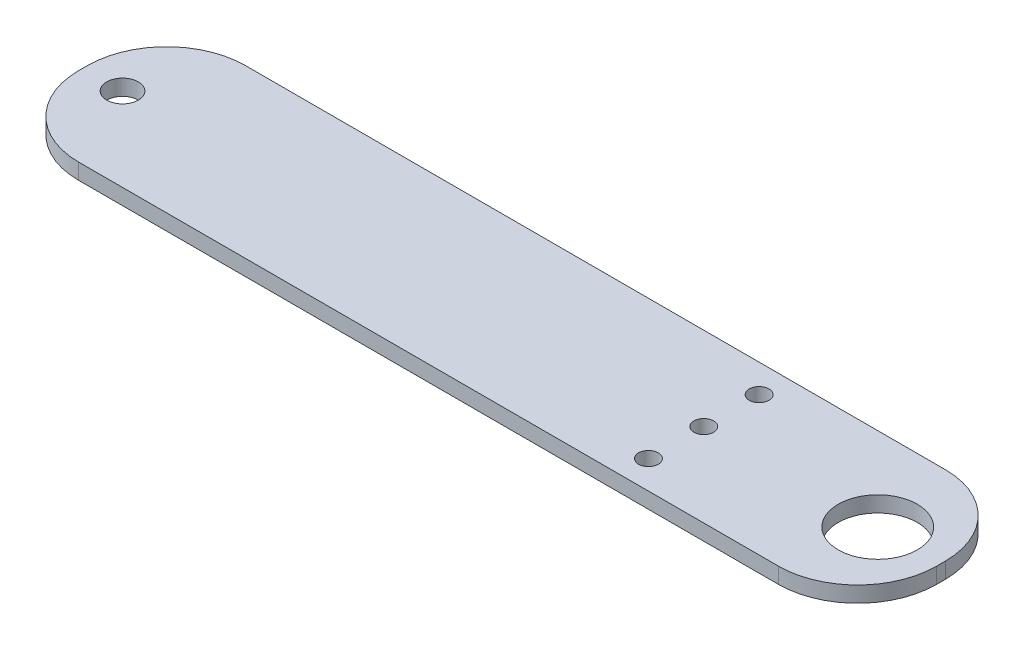
ISO-10303-21;
HEADER;
FILE_DESCRIPTION(('STEP AP214'),'2;1');
FILE_NAME('part.step','',(''),(''),'','','');
FILE_SCHEMA(('AUTOMOTIVE_DESIGN { 1 0 10303 214 1 1 1 1 }'));
ENDSEC;
DATA;
#1=APPLICATION_CONTEXT('core data for automotive mechanical design processes');
#2=APPLICATION_PROTOCOL_DEFINITION('international standard','automotive_design',2000,#1);
#3=PRODUCT_CONTEXT('',#1,'mechanical');
#4=PRODUCT('Part','Part','',(#3));
#5=PRODUCT_RELATED_PRODUCT_CATEGORY('part','',(#4));
#6=PRODUCT_DEFINITION_FORMATION('','',#4);
#7=PRODUCT_DEFINITION_CONTEXT('part definition',#1,'design');
#8=PRODUCT_DEFINITION('design','',#6,#7);
#9=PRODUCT_DEFINITION_SHAPE('','',#8);
#10=(LENGTH_UNIT() NAMED_UNIT(*) SI_UNIT(.MILLI.,.METRE.));
#11=(NAMED_UNIT(*) PLANE_ANGLE_UNIT() SI_UNIT($,.RADIAN.));
#12=(NAMED_UNIT(*) SI_UNIT($,.STERADIAN.) SOLID_ANGLE_UNIT());
#13=UNCERTAINTY_MEASURE_WITH_UNIT(LENGTH_MEASURE(1.E-05),#10,'distance_accuracy_value','');
#14=(GEOMETRIC_REPRESENTATION_CONTEXT(3) GLOBAL_UNCERTAINTY_ASSIGNED_CONTEXT((#13)) GLOBAL_UNIT_ASSIGNED_CONTEXT((#10,
#11,#12)) REPRESENTATION_CONTEXT('',''));
#15=CARTESIAN_POINT('',(0.,0.,0.));
#16=DIRECTION('',(0.,0.,1.));
#17=DIRECTION('',(1.,0.,0.));
#18=AXIS2_PLACEMENT_3D('',#15,#16,#17);
#19=CARTESIAN_POINT('',(-38.5,2.,0.));
#20=DIRECTION('',(-1.,0.,0.));
#21=DIRECTION('',(0.,0.,-1.));
#22=AXIS2_PLACEMENT_3D('',#19,#20,#21);
#23=PLANE('',#22);
#24=DIRECTION('',(0.,0.,1.));
#25=VECTOR('',#24,1.);
#26=CARTESIAN_POINT('',(-38.5,2.,0.));
#27=LINE('',#26,#25);
#28=CARTESIAN_POINT('',(-38.5,2.,-0.558375634517767));
#29=VERTEX_POINT('',#28);
#30=CARTESIAN_POINT('',(-38.5,2.,0.558375634517767));
#31=VERTEX_POINT('',#30);
#32=EDGE_CURVE('E128',#29,#31,#27,.T.);
#33=ORIENTED_EDGE('',*,*,#32,.F.);
#34=DIRECTION('',(0.,-1.,0.));
#35=VECTOR('',#34,1.);
#36=CARTESIAN_POINT('',(-38.5,2.,-0.558375634517767));
#37=LINE('',#36,#35);
#38=CARTESIAN_POINT('',(-38.5,0.,-0.558375634517767));
#39=VERTEX_POINT('',#38);
#40=EDGE_CURVE('E107',#39,#29,#37,.F.);
#41=ORIENTED_EDGE('',*,*,#40,.F.);
#42=DIRECTION('',(0.,0.,1.));
#43=VECTOR('',#42,1.);
#44=CARTESIAN_POINT('',(-38.5,0.,0.));
#45=LINE('',#44,#43);
#46=CARTESIAN_POINT('',(-38.5,0.,0.558375634517767));
#47=VERTEX_POINT('',#46);
#48=EDGE_CURVE('E118',#39,#47,#45,.T.);
#49=ORIENTED_EDGE('',*,*,#48,.T.);
#50=DIRECTION('',(0.,-1.,0.));
#51=VECTOR('',#50,1.);
#52=CARTESIAN_POINT('',(-38.5,2.,0.558375634517767));
#53=LINE('',#52,#51);
#54=EDGE_CURVE('E129',#31,#47,#53,.T.);
#55=ORIENTED_EDGE('',*,*,#54,.F.);
#56=EDGE_LOOP('',(#33,#41,#49,#55));
#57=FACE_BOUND('',#56,.T.);
#58=ADVANCED_FACE('F37',(#57),#23,.T.);
#59=CARTESIAN_POINT('',(0.,2.,-10.5583756345178));
#60=DIRECTION('',(0.,0.,1.));
#61=DIRECTION('',(-1.,0.,0.));
#62=AXIS2_PLACEMENT_3D('',#59,#60,#61);
#63=PLANE('',#62);
#64=DIRECTION('',(1.,0.,0.));
#65=VECTOR('',#64,1.);
#66=CARTESIAN_POINT('',(0.,2.,-10.5583756345178));
#67=LINE('',#66,#65);
#68=CARTESIAN_POINT('',(-28.5,2.,-10.5583756345178));
#69=VERTEX_POINT('',#68);
#70=CARTESIAN_POINT('',(60.,2.,-10.5583756345178));
#71=VERTEX_POINT('',#70);
#72=EDGE_CURVE('E164',#69,#71,#67,.T.);
#73=ORIENTED_EDGE('',*,*,#72,.T.);
#74=DIRECTION('',(0.,-1.,0.));
#75=VECTOR('',#74,1.);
#76=CARTESIAN_POINT('',(60.,2.,-10.5583756345178));
#77=LINE('',#76,#75);
#78=CARTESIAN_POINT('',(60.,0.,-10.5583756345178));
#79=VERTEX_POINT('',#78);
#80=EDGE_CURVE('E155',#79,#71,#77,.F.);
#81=ORIENTED_EDGE('',*,*,#80,.F.);
#82=DIRECTION('',(1.,0.,0.));
#83=VECTOR('',#82,1.);
#84=CARTESIAN_POINT('',(0.,0.,-10.5583756345178));
#85=LINE('',#84,#83);
#86=CARTESIAN_POINT('',(-28.5,0.,-10.5583756345178));
#87=VERTEX_POINT('',#86);
#88=EDGE_CURVE('E124',#87,#79,#85,.T.);
#89=ORIENTED_EDGE('',*,*,#88,.F.);
#90=DIRECTION('',(0.,-1.,0.));
#91=VECTOR('',#90,1.);
#92=CARTESIAN_POINT('',(-28.5,0.,-10.5583756345178));
#93=LINE('',#92,#91);
#94=EDGE_CURVE('E110',#69,#87,#93,.T.);
#95=ORIENTED_EDGE('',*,*,#94,.F.);
#96=EDGE_LOOP('',(#73,#81,#89,#95));
#97=FACE_BOUND('',#96,.T.);
#98=ADVANCED_FACE('F209',(#97),#63,.F.);
#99=CARTESIAN_POINT('',(70.,2.,0.));
#100=DIRECTION('',(1.,0.,0.));
#101=DIRECTION('',(0.,0.,1.));
#102=AXIS2_PLACEMENT_3D('',#99,#100,#101);
#103=PLANE('',#102);
#104=DIRECTION('',(0.,0.,-1.));
#105=VECTOR('',#104,1.);
#106=CARTESIAN_POINT('',(70.,2.,0.));
#107=LINE('',#106,#105);
#108=CARTESIAN_POINT('',(70.,2.,0.55837563451777));
#109=VERTEX_POINT('',#108);
#110=CARTESIAN_POINT('',(70.,2.,-0.55837563451777));
#111=VERTEX_POINT('',#110);
#112=EDGE_CURVE('E134',#109,#111,#107,.T.);
#113=ORIENTED_EDGE('',*,*,#112,.F.);
#114=DIRECTION('',(0.,-1.,0.));
#115=VECTOR('',#114,1.);
#116=CARTESIAN_POINT('',(70.,2.,0.55837563451777));
#117=LINE('',#116,#115);
#118=CARTESIAN_POINT('',(70.,0.,0.55837563451777));
#119=VERTEX_POINT('',#118);
#120=EDGE_CURVE('E45',#119,#109,#117,.F.);
#121=ORIENTED_EDGE('',*,*,#120,.F.);
#122=DIRECTION('',(0.,0.,-1.));
#123=VECTOR('',#122,1.);
#124=CARTESIAN_POINT('',(70.,0.,0.));
#125=LINE('',#124,#123);
#126=CARTESIAN_POINT('',(70.,0.,-0.55837563451777));
#127=VERTEX_POINT('',#126);
#128=EDGE_CURVE('E184',#119,#127,#125,.T.);
#129=ORIENTED_EDGE('',*,*,#128,.T.);
#130=DIRECTION('',(0.,-1.,0.));
#131=VECTOR('',#130,1.);
#132=CARTESIAN_POINT('',(70.,0.,-0.55837563451777));
#133=LINE('',#132,#131);
#134=EDGE_CURVE('E11',#111,#127,#133,.T.);
#135=ORIENTED_EDGE('',*,*,#134,.F.);
#136=EDGE_LOOP('',(#113,#121,#129,#135));
#137=FACE_BOUND('',#136,.T.);
#138=ADVANCED_FACE('F163',(#137),#103,.T.);
#139=CARTESIAN_POINT('',(62.,2.,0.));
#140=DIRECTION('',(0.,-1.,0.));
#141=DIRECTION('',(0.,0.,1.));
#142=AXIS2_PLACEMENT_3D('',#139,#140,#141);
#143=CYLINDRICAL_SURFACE('',#142,5.);
#144=CARTESIAN_POINT('',(62.,2.,0.));
#145=DIRECTION('',(0.,-1.,0.));
#146=DIRECTION('',(0.,0.,-1.));
#147=AXIS2_PLACEMENT_3D('',#144,#145,#146);
#148=CIRCLE('',#147,5.);
#149=CARTESIAN_POINT('',(62.,2.,-4.99999999999998));
#150=VERTEX_POINT('',#149);
#151=EDGE_CURVE('E204',#150,#150,#148,.T.);
#152=ORIENTED_EDGE('',*,*,#151,.F.);
#153=EDGE_LOOP('',(#152));
#154=FACE_BOUND('',#153,.T.);
#155=CARTESIAN_POINT('',(62.,0.,0.));
#156=DIRECTION('',(0.,-1.,0.));
#157=DIRECTION('',(0.,0.,-1.));
#158=AXIS2_PLACEMENT_3D('',#155,#156,#157);
#159=CIRCLE('',#158,5.);
#160=CARTESIAN_POINT('',(62.,0.,-4.99999999999998));
#161=VERTEX_POINT('',#160);
#162=EDGE_CURVE('E125',#161,#161,#159,.T.);
#163=ORIENTED_EDGE('',*,*,#162,.T.);
#164=EDGE_LOOP('',(#163));
#165=FACE_BOUND('',#164,.T.);
#166=ADVANCED_FACE('F227',(#154,#165),#143,.F.);
#167=CARTESIAN_POINT('',(-33.5000000000009,2.,1.31838984174237E-13));
#168=DIRECTION('',(0.,-1.,0.));
#169=DIRECTION('',(0.,0.,1.));
#170=AXIS2_PLACEMENT_3D('',#167,#168,#169);
#171=CYLINDRICAL_SURFACE('',#170,2.00000000000091);
#172=CARTESIAN_POINT('',(-33.5000000000009,2.,1.31838984174237E-13));
#173=DIRECTION('',(0.,-1.,0.));
#174=DIRECTION('',(0.,0.,-1.));
#175=AXIS2_PLACEMENT_3D('',#172,#173,#174);
#176=CIRCLE('',#175,2.00000000000091);
#177=CARTESIAN_POINT('',(-33.5000000000009,2.,-2.00000000000078));
#178=VERTEX_POINT('',#177);
#179=EDGE_CURVE('E201',#178,#178,#176,.T.);
#180=ORIENTED_EDGE('',*,*,#179,.F.);
#181=EDGE_LOOP('',(#180));
#182=FACE_BOUND('',#181,.T.);
#183=CARTESIAN_POINT('',(-33.5000000000009,0.,1.31838984174237E-13));
#184=DIRECTION('',(0.,-1.,0.));
#185=DIRECTION('',(0.,0.,-1.));
#186=AXIS2_PLACEMENT_3D('',#183,#184,#185);
#187=CIRCLE('',#186,2.00000000000091);
#188=CARTESIAN_POINT('',(-33.5000000000009,0.,-2.00000000000078));
#189=VERTEX_POINT('',#188);
#190=EDGE_CURVE('E179',#189,#189,#187,.T.);
#191=ORIENTED_EDGE('',*,*,#190,.T.);
#192=EDGE_LOOP('',(#191));
#193=FACE_BOUND('',#192,.T.);
#194=ADVANCED_FACE('F230',(#182,#193),#171,.F.);
#195=CARTESIAN_POINT('',(40.,2.,0.));
#196=DIRECTION('',(0.,-1.,0.));
#197=DIRECTION('',(0.,0.,1.));
#198=AXIS2_PLACEMENT_3D('',#195,#196,#197);
#199=CYLINDRICAL_SURFACE('',#198,1.25);
#200=CARTESIAN_POINT('',(40.,2.,0.));
#201=DIRECTION('',(0.,-1.,0.));
#202=DIRECTION('',(0.,0.,-1.));
#203=AXIS2_PLACEMENT_3D('',#200,#201,#202);
#204=CIRCLE('',#203,1.25);
#205=CARTESIAN_POINT('',(40.,2.,-1.24999999999999));
#206=VERTEX_POINT('',#205);
#207=EDGE_CURVE('E196',#206,#206,#204,.T.);
#208=ORIENTED_EDGE('',*,*,#207,.F.);
#209=EDGE_LOOP('',(#208));
#210=FACE_BOUND('',#209,.T.);
#211=CARTESIAN_POINT('',(40.,0.,0.));
#212=DIRECTION('',(0.,-1.,0.));
#213=DIRECTION('',(0.,0.,-1.));
#214=AXIS2_PLACEMENT_3D('',#211,#212,#213);
#215=CIRCLE('',#214,1.25);
#216=CARTESIAN_POINT('',(40.,0.,-1.24999999999999));
#217=VERTEX_POINT('',#216);
#218=EDGE_CURVE('E176',#217,#217,#215,.T.);
#219=ORIENTED_EDGE('',*,*,#218,.T.);
#220=EDGE_LOOP('',(#219));
#221=FACE_BOUND('',#220,.T.);
#222=ADVANCED_FACE('F234',(#210,#221),#199,.F.);
#223=CARTESIAN_POINT('',(40.,2.,7.00000000000001));
#224=DIRECTION('',(0.,-1.,0.));
#225=DIRECTION('',(0.,0.,1.));
#226=AXIS2_PLACEMENT_3D('',#223,#224,#225);
#227=CYLINDRICAL_SURFACE('',#226,1.25);
#228=CARTESIAN_POINT('',(40.,2.,7.00000000000001));
#229=DIRECTION('',(0.,-1.,0.));
#230=DIRECTION('',(0.,0.,-1.));
#231=AXIS2_PLACEMENT_3D('',#228,#229,#230);
#232=CIRCLE('',#231,1.25);
#233=CARTESIAN_POINT('',(40.,2.,5.75000000000001));
#234=VERTEX_POINT('',#233);
#235=EDGE_CURVE('E191',#234,#234,#232,.T.);
#236=ORIENTED_EDGE('',*,*,#235,.F.);
#237=EDGE_LOOP('',(#236));
#238=FACE_BOUND('',#237,.T.);
#239=CARTESIAN_POINT('',(40.,0.,7.00000000000001));
#240=DIRECTION('',(0.,-1.,0.));
#241=DIRECTION('',(0.,0.,-1.));
#242=AXIS2_PLACEMENT_3D('',#239,#240,#241);
#243=CIRCLE('',#242,1.25);
#244=CARTESIAN_POINT('',(40.,0.,5.75000000000001));
#245=VERTEX_POINT('',#244);
#246=EDGE_CURVE('E173',#245,#245,#243,.T.);
#247=ORIENTED_EDGE('',*,*,#246,.T.);
#248=EDGE_LOOP('',(#247));
#249=FACE_BOUND('',#248,.T.);
#250=ADVANCED_FACE('F238',(#238,#249),#227,.F.);
#251=CARTESIAN_POINT('',(40.,2.,-6.99999999999999));
#252=DIRECTION('',(0.,-1.,0.));
#253=DIRECTION('',(0.,0.,1.));
#254=AXIS2_PLACEMENT_3D('',#251,#252,#253);
#255=CYLINDRICAL_SURFACE('',#254,1.25);
#256=CARTESIAN_POINT('',(40.,2.,-6.99999999999999));
#257=DIRECTION('',(0.,-1.,0.));
#258=DIRECTION('',(0.,0.,-1.));
#259=AXIS2_PLACEMENT_3D('',#256,#257,#258);
#260=CIRCLE('',#259,1.25);
#261=CARTESIAN_POINT('',(40.,2.,-8.24999999999999));
#262=VERTEX_POINT('',#261);
#263=EDGE_CURVE('E186',#262,#262,#260,.T.);
#264=ORIENTED_EDGE('',*,*,#263,.F.);
#265=EDGE_LOOP('',(#264));
#266=FACE_BOUND('',#265,.T.);
#267=CARTESIAN_POINT('',(40.,0.,-6.99999999999999));
#268=DIRECTION('',(0.,-1.,0.));
#269=DIRECTION('',(0.,0.,-1.));
#270=AXIS2_PLACEMENT_3D('',#267,#268,#269);
#271=CIRCLE('',#270,1.25);
#272=CARTESIAN_POINT('',(40.,0.,-8.24999999999999));
#273=VERTEX_POINT('',#272);
#274=EDGE_CURVE('E170',#273,#273,#271,.T.);
#275=ORIENTED_EDGE('',*,*,#274,.T.);
#276=EDGE_LOOP('',(#275));
#277=FACE_BOUND('',#276,.T.);
#278=ADVANCED_FACE('F242',(#266,#277),#255,.F.);
#279=CARTESIAN_POINT('',(0.,2.,10.5583756345178));
#280=DIRECTION('',(0.,0.,1.));
#281=DIRECTION('',(-1.,0.,0.));
#282=AXIS2_PLACEMENT_3D('',#279,#280,#281);
#283=PLANE('',#282);
#284=DIRECTION('',(1.,0.,0.));
#285=VECTOR('',#284,1.);
#286=CARTESIAN_POINT('',(0.,0.,10.5583756345178));
#287=LINE('',#286,#285);
#288=CARTESIAN_POINT('',(-28.5,0.,10.5583756345178));
#289=VERTEX_POINT('',#288);
#290=CARTESIAN_POINT('',(60.,0.,10.5583756345178));
#291=VERTEX_POINT('',#290);
#292=EDGE_CURVE('E137',#289,#291,#287,.T.);
#293=ORIENTED_EDGE('',*,*,#292,.T.);
#294=DIRECTION('',(0.,-1.,0.));
#295=VECTOR('',#294,1.);
#296=CARTESIAN_POINT('',(60.,2.,10.5583756345178));
#297=LINE('',#296,#295);
#298=CARTESIAN_POINT('',(60.,2.,10.5583756345178));
#299=VERTEX_POINT('',#298);
#300=EDGE_CURVE('E143',#299,#291,#297,.T.);
#301=ORIENTED_EDGE('',*,*,#300,.F.);
#302=DIRECTION('',(1.,0.,0.));
#303=VECTOR('',#302,1.);
#304=CARTESIAN_POINT('',(0.,2.,10.5583756345178));
#305=LINE('',#304,#303);
#306=CARTESIAN_POINT('',(-28.5,2.,10.5583756345178));
#307=VERTEX_POINT('',#306);
#308=EDGE_CURVE('E130',#307,#299,#305,.T.);
#309=ORIENTED_EDGE('',*,*,#308,.F.);
#310=DIRECTION('',(0.,-1.,0.));
#311=VECTOR('',#310,1.);
#312=CARTESIAN_POINT('',(-28.5,2.,10.5583756345178));
#313=LINE('',#312,#311);
#314=EDGE_CURVE('E146',#289,#307,#313,.F.);
#315=ORIENTED_EDGE('',*,*,#314,.F.);
#316=EDGE_LOOP('',(#293,#301,#309,#315));
#317=FACE_BOUND('',#316,.T.);
#318=ADVANCED_FACE('F246',(#317),#283,.T.);
#319=CARTESIAN_POINT('',(0.,2.,0.));
#320=DIRECTION('',(0.,1.,0.));
#321=DIRECTION('',(0.,0.,-1.));
#322=AXIS2_PLACEMENT_3D('',#319,#320,#321);
#323=PLANE('',#322);
#324=ORIENTED_EDGE('',*,*,#263,.T.);
#325=EDGE_LOOP('',(#324));
#326=FACE_BOUND('',#325,.T.);
#327=ORIENTED_EDGE('',*,*,#235,.T.);
#328=EDGE_LOOP('',(#327));
#329=FACE_BOUND('',#328,.T.);
#330=ORIENTED_EDGE('',*,*,#207,.T.);
#331=EDGE_LOOP('',(#330));
#332=FACE_BOUND('',#331,.T.);
#333=ORIENTED_EDGE('',*,*,#179,.T.);
#334=EDGE_LOOP('',(#333));
#335=FACE_BOUND('',#334,.T.);
#336=ORIENTED_EDGE('',*,*,#151,.T.);
#337=EDGE_LOOP('',(#336));
#338=FACE_BOUND('',#337,.T.);
#339=ORIENTED_EDGE('',*,*,#308,.T.);
#340=CARTESIAN_POINT('',(60.,2.,0.55837563451777));
#341=DIRECTION('',(0.,-1.,0.));
#342=DIRECTION('',(0.,0.,-1.));
#343=AXIS2_PLACEMENT_3D('',#340,#341,#342);
#344=CIRCLE('',#343,10.);
#345=EDGE_CURVE('E59',#109,#299,#344,.T.);
#346=ORIENTED_EDGE('',*,*,#345,.F.);
#347=ORIENTED_EDGE('',*,*,#112,.T.);
#348=CARTESIAN_POINT('',(60.,2.,-0.55837563451777));
#349=DIRECTION('',(0.,-1.,0.));
#350=DIRECTION('',(0.,0.,-1.));
#351=AXIS2_PLACEMENT_3D('',#348,#349,#350);
#352=CIRCLE('',#351,10.);
#353=EDGE_CURVE('E51',#71,#111,#352,.T.);
#354=ORIENTED_EDGE('',*,*,#353,.F.);
#355=ORIENTED_EDGE('',*,*,#72,.F.);
#356=CARTESIAN_POINT('',(-28.5,2.,-0.558375634517767));
#357=DIRECTION('',(0.,-1.,0.));
#358=DIRECTION('',(0.,0.,-1.));
#359=AXIS2_PLACEMENT_3D('',#356,#357,#358);
#360=CIRCLE('',#359,10.);
#361=EDGE_CURVE('E151',#29,#69,#360,.T.);
#362=ORIENTED_EDGE('',*,*,#361,.F.);
#363=ORIENTED_EDGE('',*,*,#32,.T.);
#364=CARTESIAN_POINT('',(-28.5,2.,0.558375634517767));
#365=DIRECTION('',(0.,-1.,0.));
#366=DIRECTION('',(0.,0.,-1.));
#367=AXIS2_PLACEMENT_3D('',#364,#365,#366);
#368=CIRCLE('',#367,10.);
#369=EDGE_CURVE('E153',#307,#31,#368,.T.);
#370=ORIENTED_EDGE('',*,*,#369,.F.);
#371=EDGE_LOOP('',(#339,#346,#347,#354,#355,#362,#363,#370));
#372=FACE_BOUND('',#371,.T.);
#373=ADVANCED_FACE('F206',(#326,#329,#332,#335,#338,#372),#323,.T.);
#374=CARTESIAN_POINT('',(0.,0.,0.));
#375=DIRECTION('',(0.,1.,0.));
#376=DIRECTION('',(0.,0.,-1.));
#377=AXIS2_PLACEMENT_3D('',#374,#375,#376);
#378=PLANE('',#377);
#379=ORIENTED_EDGE('',*,*,#274,.F.);
#380=EDGE_LOOP('',(#379));
#381=FACE_BOUND('',#380,.T.);
#382=ORIENTED_EDGE('',*,*,#246,.F.);
#383=EDGE_LOOP('',(#382));
#384=FACE_BOUND('',#383,.T.);
#385=ORIENTED_EDGE('',*,*,#218,.F.);
#386=EDGE_LOOP('',(#385));
#387=FACE_BOUND('',#386,.T.);
#388=ORIENTED_EDGE('',*,*,#190,.F.);
#389=EDGE_LOOP('',(#388));
#390=FACE_BOUND('',#389,.T.);
#391=ORIENTED_EDGE('',*,*,#162,.F.);
#392=EDGE_LOOP('',(#391));
#393=FACE_BOUND('',#392,.T.);
#394=ORIENTED_EDGE('',*,*,#48,.F.);
#395=CARTESIAN_POINT('',(-28.5,0.,-0.558375634517767));
#396=DIRECTION('',(0.,-1.,0.));
#397=DIRECTION('',(0.,0.,-1.));
#398=AXIS2_PLACEMENT_3D('',#395,#396,#397);
#399=CIRCLE('',#398,10.);
#400=EDGE_CURVE('E103',#87,#39,#399,.F.);
#401=ORIENTED_EDGE('',*,*,#400,.F.);
#402=ORIENTED_EDGE('',*,*,#88,.T.);
#403=CARTESIAN_POINT('',(60.,0.,-0.55837563451777));
#404=DIRECTION('',(0.,-1.,0.));
#405=DIRECTION('',(0.,0.,-1.));
#406=AXIS2_PLACEMENT_3D('',#403,#404,#405);
#407=CIRCLE('',#406,10.);
#408=EDGE_CURVE('E115',#127,#79,#407,.F.);
#409=ORIENTED_EDGE('',*,*,#408,.F.);
#410=ORIENTED_EDGE('',*,*,#128,.F.);
#411=CARTESIAN_POINT('',(60.,0.,0.55837563451777));
#412=DIRECTION('',(0.,-1.,0.));
#413=DIRECTION('',(0.,0.,-1.));
#414=AXIS2_PLACEMENT_3D('',#411,#412,#413);
#415=CIRCLE('',#414,10.);
#416=EDGE_CURVE('E132',#291,#119,#415,.F.);
#417=ORIENTED_EDGE('',*,*,#416,.F.);
#418=ORIENTED_EDGE('',*,*,#292,.F.);
#419=CARTESIAN_POINT('',(-28.5,0.,0.558375634517767));
#420=DIRECTION('',(0.,-1.,0.));
#421=DIRECTION('',(0.,0.,-1.));
#422=AXIS2_PLACEMENT_3D('',#419,#420,#421);
#423=CIRCLE('',#422,10.);
#424=EDGE_CURVE('E114',#47,#289,#423,.F.);
#425=ORIENTED_EDGE('',*,*,#424,.F.);
#426=EDGE_LOOP('',(#394,#401,#402,#409,#410,#417,#418,#425));
#427=FACE_BOUND('',#426,.T.);
#428=ADVANCED_FACE('F119',(#381,#384,#387,#390,#393,#427),#378,.F.);
#429=CARTESIAN_POINT('',(-28.5,2.,0.558375634517767));
#430=DIRECTION('',(0.,-1.,0.));
#431=DIRECTION('',(0.,0.,1.));
#432=AXIS2_PLACEMENT_3D('',#429,#430,#431);
#433=CYLINDRICAL_SURFACE('',#432,10.);
#434=ORIENTED_EDGE('',*,*,#369,.T.);
#435=ORIENTED_EDGE('',*,*,#54,.T.);
#436=ORIENTED_EDGE('',*,*,#424,.T.);
#437=ORIENTED_EDGE('',*,*,#314,.T.);
#438=EDGE_LOOP('',(#434,#435,#436,#437));
#439=FACE_BOUND('',#438,.T.);
#440=ADVANCED_FACE('F217',(#439),#433,.T.);
#441=CARTESIAN_POINT('',(-28.5,2.,-0.558375634517767));
#442=DIRECTION('',(0.,1.,0.));
#443=DIRECTION('',(0.,0.,-1.));
#444=AXIS2_PLACEMENT_3D('',#441,#442,#443);
#445=CYLINDRICAL_SURFACE('',#444,10.);
#446=ORIENTED_EDGE('',*,*,#361,.T.);
#447=ORIENTED_EDGE('',*,*,#94,.T.);
#448=ORIENTED_EDGE('',*,*,#400,.T.);
#449=ORIENTED_EDGE('',*,*,#40,.T.);
#450=EDGE_LOOP('',(#446,#447,#448,#449));
#451=FACE_BOUND('',#450,.T.);
#452=ADVANCED_FACE('F105',(#451),#445,.T.);
#453=CARTESIAN_POINT('',(60.,2.,-0.55837563451777));
#454=DIRECTION('',(0.,1.,0.));
#455=DIRECTION('',(0.,0.,-1.));
#456=AXIS2_PLACEMENT_3D('',#453,#454,#455);
#457=CYLINDRICAL_SURFACE('',#456,10.);
#458=ORIENTED_EDGE('',*,*,#353,.T.);
#459=ORIENTED_EDGE('',*,*,#134,.T.);
#460=ORIENTED_EDGE('',*,*,#408,.T.);
#461=ORIENTED_EDGE('',*,*,#80,.T.);
#462=EDGE_LOOP('',(#458,#459,#460,#461));
#463=FACE_BOUND('',#462,.T.);
#464=ADVANCED_FACE('F211',(#463),#457,.T.);
#465=CARTESIAN_POINT('',(60.,2.,0.55837563451777));
#466=DIRECTION('',(0.,-1.,0.));
#467=DIRECTION('',(0.,0.,1.));
#468=AXIS2_PLACEMENT_3D('',#465,#466,#467);
#469=CYLINDRICAL_SURFACE('',#468,10.);
#470=ORIENTED_EDGE('',*,*,#345,.T.);
#471=ORIENTED_EDGE('',*,*,#300,.T.);
#472=ORIENTED_EDGE('',*,*,#416,.T.);
#473=ORIENTED_EDGE('',*,*,#120,.T.);
#474=EDGE_LOOP('',(#470,#471,#472,#473));
#475=FACE_BOUND('',#474,.T.);
#476=ADVANCED_FACE('F39',(#475),#469,.T.);
#477=CLOSED_SHELL('',(#58,#98,#138,#166,#194,#222,#250,#278,#318,#373,#428,#440,#452,#464,#476));
#478=MANIFOLD_SOLID_BREP('B2',#477);
#479=ADVANCED_BREP_SHAPE_REPRESENTATION('',(#18,#478),#14);
#480=SHAPE_DEFINITION_REPRESENTATION(#9,#479);
ENDSEC;
END-ISO-10303-21;
